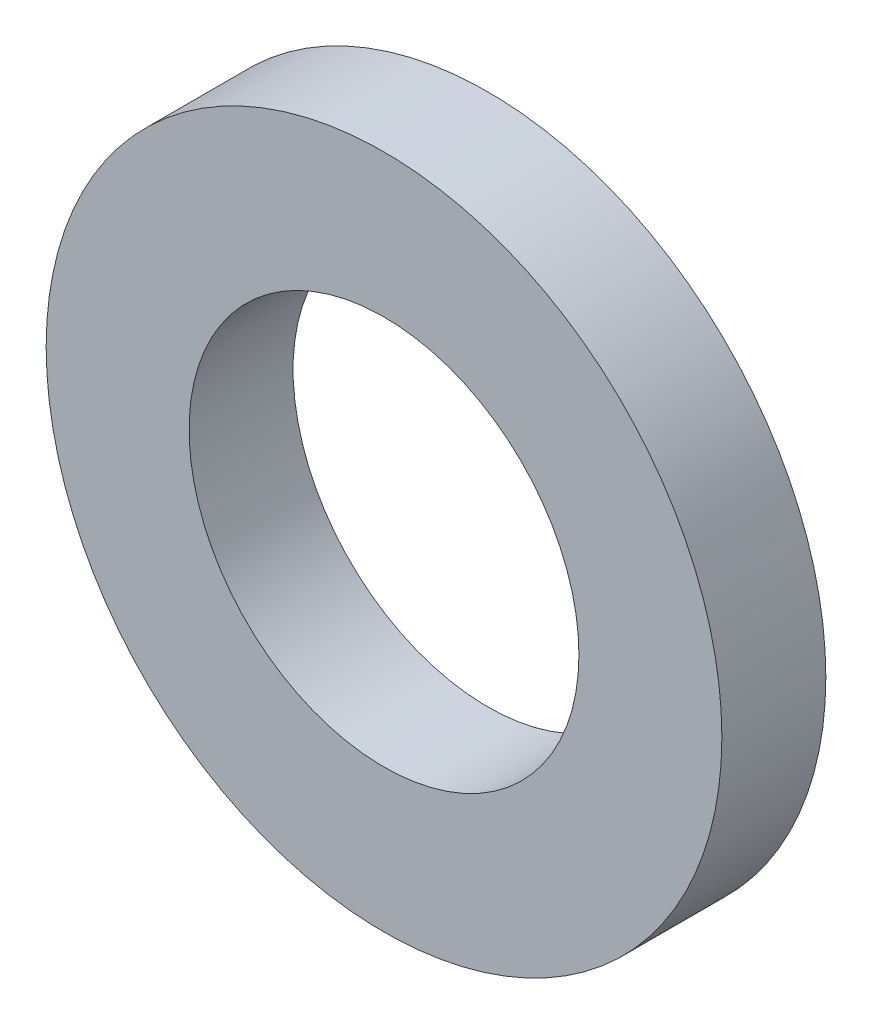
ISO-10303-21;
HEADER;
FILE_DESCRIPTION(('STEP AP214'),'2;1');
FILE_NAME('part.step','',(''),(''),'','','');
FILE_SCHEMA(('AUTOMOTIVE_DESIGN { 1 0 10303 214 1 1 1 1 }'));
ENDSEC;
DATA;
#1=APPLICATION_CONTEXT('core data for automotive mechanical design processes');
#2=APPLICATION_PROTOCOL_DEFINITION('international standard','automotive_design',2000,#1);
#3=PRODUCT_CONTEXT('',#1,'mechanical');
#4=PRODUCT('Part','Part','',(#3));
#5=PRODUCT_RELATED_PRODUCT_CATEGORY('part','',(#4));
#6=PRODUCT_DEFINITION_FORMATION('','',#4);
#7=PRODUCT_DEFINITION_CONTEXT('part definition',#1,'design');
#8=PRODUCT_DEFINITION('design','',#6,#7);
#9=PRODUCT_DEFINITION_SHAPE('','',#8);
#10=(LENGTH_UNIT() NAMED_UNIT(*) SI_UNIT(.MILLI.,.METRE.));
#11=(NAMED_UNIT(*) PLANE_ANGLE_UNIT() SI_UNIT($,.RADIAN.));
#12=(NAMED_UNIT(*) SI_UNIT($,.STERADIAN.) SOLID_ANGLE_UNIT());
#13=UNCERTAINTY_MEASURE_WITH_UNIT(LENGTH_MEASURE(1.E-05),#10,'distance_accuracy_value','');
#14=(GEOMETRIC_REPRESENTATION_CONTEXT(3) GLOBAL_UNCERTAINTY_ASSIGNED_CONTEXT((#13)) GLOBAL_UNIT_ASSIGNED_CONTEXT((#10,
#11,#12)) REPRESENTATION_CONTEXT('',''));
#15=CARTESIAN_POINT('',(0.,0.,0.));
#16=DIRECTION('',(0.,0.,1.));
#17=DIRECTION('',(1.,0.,0.));
#18=AXIS2_PLACEMENT_3D('',#15,#16,#17);
#19=CARTESIAN_POINT('',(0.,0.,4.));
#20=DIRECTION('',(0.,0.,1.));
#21=DIRECTION('',(1.,0.,0.));
#22=AXIS2_PLACEMENT_3D('',#19,#20,#21);
#23=PLANE('',#22);
#24=CARTESIAN_POINT('',(0.,0.,4.));
#25=DIRECTION('',(0.,0.,1.));
#26=DIRECTION('',(1.,0.,0.));
#27=AXIS2_PLACEMENT_3D('',#24,#25,#26);
#28=CIRCLE('',#27,13.);
#29=CARTESIAN_POINT('',(13.,0.,4.));
#30=VERTEX_POINT('',#29);
#31=EDGE_CURVE('E10',#30,#30,#28,.T.);
#32=ORIENTED_EDGE('',*,*,#31,.T.);
#33=EDGE_LOOP('',(#32));
#34=FACE_BOUND('',#33,.T.);
#35=CARTESIAN_POINT('',(0.,0.,4.));
#36=DIRECTION('',(0.,0.,1.));
#37=DIRECTION('',(1.,0.,0.));
#38=AXIS2_PLACEMENT_3D('',#35,#36,#37);
#39=CIRCLE('',#38,7.5);
#40=CARTESIAN_POINT('',(7.5,0.,4.));
#41=VERTEX_POINT('',#40);
#42=EDGE_CURVE('E52',#41,#41,#39,.T.);
#43=ORIENTED_EDGE('',*,*,#42,.F.);
#44=EDGE_LOOP('',(#43));
#45=FACE_BOUND('',#44,.T.);
#46=ADVANCED_FACE('F38',(#34,#45),#23,.T.);
#47=CARTESIAN_POINT('',(0.,0.,0.));
#48=DIRECTION('',(0.,0.,1.));
#49=DIRECTION('',(1.,0.,0.));
#50=AXIS2_PLACEMENT_3D('',#47,#48,#49);
#51=PLANE('',#50);
#52=CARTESIAN_POINT('',(0.,0.,0.));
#53=DIRECTION('',(0.,0.,1.));
#54=DIRECTION('',(1.,0.,0.));
#55=AXIS2_PLACEMENT_3D('',#52,#53,#54);
#56=CIRCLE('',#55,13.);
#57=CARTESIAN_POINT('',(13.,0.,0.));
#58=VERTEX_POINT('',#57);
#59=EDGE_CURVE('E42',#58,#58,#56,.T.);
#60=ORIENTED_EDGE('',*,*,#59,.F.);
#61=EDGE_LOOP('',(#60));
#62=FACE_BOUND('',#61,.T.);
#63=CARTESIAN_POINT('',(0.,0.,0.));
#64=DIRECTION('',(0.,0.,1.));
#65=DIRECTION('',(1.,0.,0.));
#66=AXIS2_PLACEMENT_3D('',#63,#64,#65);
#67=CIRCLE('',#66,7.5);
#68=CARTESIAN_POINT('',(7.5,0.,0.));
#69=VERTEX_POINT('',#68);
#70=EDGE_CURVE('E54',#69,#69,#67,.T.);
#71=ORIENTED_EDGE('',*,*,#70,.T.);
#72=EDGE_LOOP('',(#71));
#73=FACE_BOUND('',#72,.T.);
#74=ADVANCED_FACE('F65',(#62,#73),#51,.F.);
#75=CARTESIAN_POINT('',(0.,0.,4.));
#76=DIRECTION('',(0.,0.,-1.));
#77=DIRECTION('',(-1.,0.,0.));
#78=AXIS2_PLACEMENT_3D('',#75,#76,#77);
#79=CYLINDRICAL_SURFACE('',#78,13.);
#80=ORIENTED_EDGE('',*,*,#31,.F.);
#81=EDGE_LOOP('',(#80));
#82=FACE_BOUND('',#81,.T.);
#83=ORIENTED_EDGE('',*,*,#59,.T.);
#84=EDGE_LOOP('',(#83));
#85=FACE_BOUND('',#84,.T.);
#86=ADVANCED_FACE('F40',(#82,#85),#79,.T.);
#87=CARTESIAN_POINT('',(0.,0.,4.));
#88=DIRECTION('',(0.,0.,-1.));
#89=DIRECTION('',(-1.,0.,0.));
#90=AXIS2_PLACEMENT_3D('',#87,#88,#89);
#91=CYLINDRICAL_SURFACE('',#90,7.5);
#92=ORIENTED_EDGE('',*,*,#42,.T.);
#93=EDGE_LOOP('',(#92));
#94=FACE_BOUND('',#93,.T.);
#95=ORIENTED_EDGE('',*,*,#70,.F.);
#96=EDGE_LOOP('',(#95));
#97=FACE_BOUND('',#96,.T.);
#98=ADVANCED_FACE('F61',(#94,#97),#91,.F.);
#99=CLOSED_SHELL('',(#46,#74,#86,#98));
#100=MANIFOLD_SOLID_BREP('B2',#99);
#101=ADVANCED_BREP_SHAPE_REPRESENTATION('',(#18,#100),#14);
#102=SHAPE_DEFINITION_REPRESENTATION(#9,#101);
ENDSEC;
END-ISO-10303-21;
